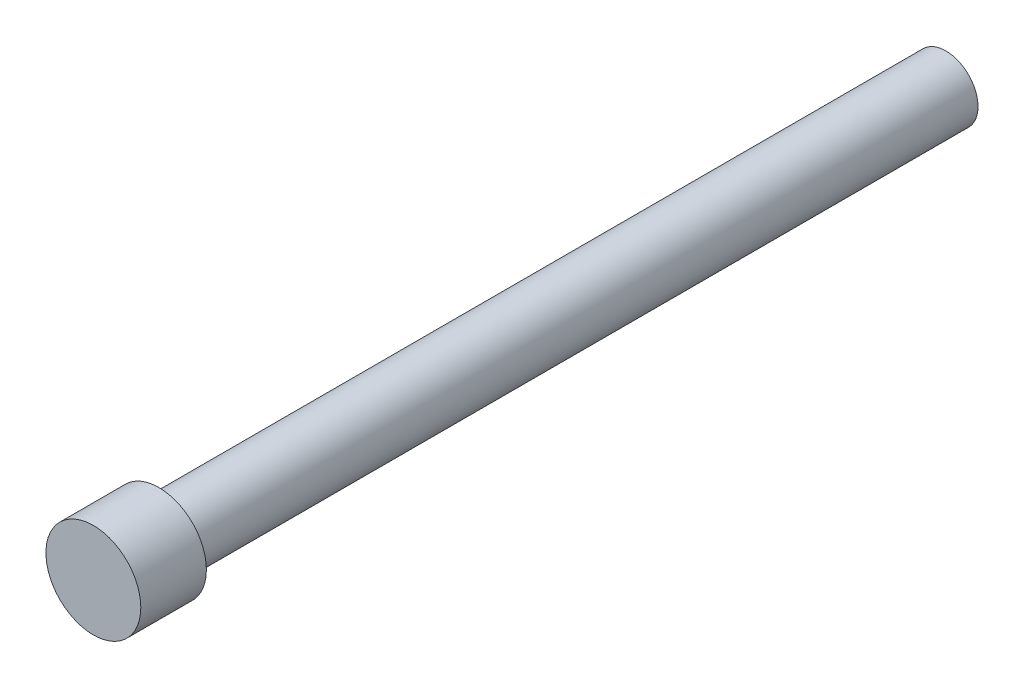
ISO-10303-21;
HEADER;
FILE_DESCRIPTION(('STEP AP214'),'2;1');
FILE_NAME('part.step','',(''),(''),'','','');
FILE_SCHEMA(('AUTOMOTIVE_DESIGN { 1 0 10303 214 1 1 1 1 }'));
ENDSEC;
DATA;
#1=APPLICATION_CONTEXT('core data for automotive mechanical design processes');
#2=APPLICATION_PROTOCOL_DEFINITION('international standard','automotive_design',2000,#1);
#3=PRODUCT_CONTEXT('',#1,'mechanical');
#4=PRODUCT('Part','Part','',(#3));
#5=PRODUCT_RELATED_PRODUCT_CATEGORY('part','',(#4));
#6=PRODUCT_DEFINITION_FORMATION('','',#4);
#7=PRODUCT_DEFINITION_CONTEXT('part definition',#1,'design');
#8=PRODUCT_DEFINITION('design','',#6,#7);
#9=PRODUCT_DEFINITION_SHAPE('','',#8);
#10=(LENGTH_UNIT() NAMED_UNIT(*) SI_UNIT(.MILLI.,.METRE.));
#11=(NAMED_UNIT(*) PLANE_ANGLE_UNIT() SI_UNIT($,.RADIAN.));
#12=(NAMED_UNIT(*) SI_UNIT($,.STERADIAN.) SOLID_ANGLE_UNIT());
#13=UNCERTAINTY_MEASURE_WITH_UNIT(LENGTH_MEASURE(1.E-05),#10,'distance_accuracy_value','');
#14=(GEOMETRIC_REPRESENTATION_CONTEXT(3) GLOBAL_UNCERTAINTY_ASSIGNED_CONTEXT((#13)) GLOBAL_UNIT_ASSIGNED_CONTEXT((#10,
#11,#12)) REPRESENTATION_CONTEXT('',''));
#15=CARTESIAN_POINT('',(0.,0.,0.));
#16=DIRECTION('',(0.,0.,1.));
#17=DIRECTION('',(1.,0.,0.));
#18=AXIS2_PLACEMENT_3D('',#15,#16,#17);
#19=CARTESIAN_POINT('',(-17.2735032288176,7.44180859691808,60.));
#20=DIRECTION('',(0.,0.,-1.));
#21=DIRECTION('',(-1.,0.,0.));
#22=AXIS2_PLACEMENT_3D('',#19,#20,#21);
#23=CYLINDRICAL_SURFACE('',#22,2.45);
#24=CARTESIAN_POINT('',(-17.2735032288176,7.44180859691808,60.));
#25=DIRECTION('',(0.,0.,1.));
#26=DIRECTION('',(1.,0.,0.));
#27=AXIS2_PLACEMENT_3D('',#24,#25,#26);
#28=CIRCLE('',#27,2.45);
#29=CARTESIAN_POINT('',(-14.8235032288176,7.44180859691808,60.));
#30=VERTEX_POINT('',#29);
#31=EDGE_CURVE('E10',#30,#30,#28,.T.);
#32=ORIENTED_EDGE('',*,*,#31,.F.);
#33=EDGE_LOOP('',(#32));
#34=FACE_BOUND('',#33,.T.);
#35=CARTESIAN_POINT('',(-17.2735032288176,7.44180859691808,0.));
#36=DIRECTION('',(0.,0.,1.));
#37=DIRECTION('',(1.,0.,0.));
#38=AXIS2_PLACEMENT_3D('',#35,#36,#37);
#39=CIRCLE('',#38,2.45);
#40=CARTESIAN_POINT('',(-14.8235032288176,7.44180859691808,0.));
#41=VERTEX_POINT('',#40);
#42=EDGE_CURVE('E36',#41,#41,#39,.T.);
#43=ORIENTED_EDGE('',*,*,#42,.T.);
#44=EDGE_LOOP('',(#43));
#45=FACE_BOUND('',#44,.T.);
#46=ADVANCED_FACE('F33',(#34,#45),#23,.T.);
#47=CARTESIAN_POINT('',(-17.2735032288176,7.44180859691808,0.));
#48=DIRECTION('',(0.,0.,1.));
#49=DIRECTION('',(1.,0.,0.));
#50=AXIS2_PLACEMENT_3D('',#47,#48,#49);
#51=PLANE('',#50);
#52=ORIENTED_EDGE('',*,*,#42,.F.);
#53=EDGE_LOOP('',(#52));
#54=FACE_BOUND('',#53,.T.);
#55=ADVANCED_FACE('F61',(#54),#51,.F.);
#56=CARTESIAN_POINT('',(0.,0.,60.));
#57=DIRECTION('',(0.,0.,1.));
#58=DIRECTION('',(1.,0.,0.));
#59=AXIS2_PLACEMENT_3D('',#56,#57,#58);
#60=PLANE('',#59);
#61=CARTESIAN_POINT('',(-17.2735032288176,7.44180859691808,60.));
#62=DIRECTION('',(0.,0.,1.));
#63=DIRECTION('',(1.,0.,0.));
#64=AXIS2_PLACEMENT_3D('',#61,#62,#63);
#65=CIRCLE('',#64,3.61759878289181);
#66=CARTESIAN_POINT('',(-13.6559044459258,7.44180859691808,60.));
#67=VERTEX_POINT('',#66);
#68=EDGE_CURVE('E45',#67,#67,#65,.T.);
#69=ORIENTED_EDGE('',*,*,#68,.F.);
#70=EDGE_LOOP('',(#69));
#71=FACE_BOUND('',#70,.T.);
#72=ORIENTED_EDGE('',*,*,#31,.T.);
#73=EDGE_LOOP('',(#72));
#74=FACE_BOUND('',#73,.T.);
#75=ADVANCED_FACE('F56',(#71,#74),#60,.F.);
#76=CARTESIAN_POINT('',(-17.2735032288176,7.44180859691808,65.));
#77=DIRECTION('',(0.,0.,-1.));
#78=DIRECTION('',(-1.,0.,0.));
#79=AXIS2_PLACEMENT_3D('',#76,#77,#78);
#80=CYLINDRICAL_SURFACE('',#79,3.61759878289181);
#81=CARTESIAN_POINT('',(-17.2735032288176,7.44180859691808,65.));
#82=DIRECTION('',(0.,0.,1.));
#83=DIRECTION('',(1.,0.,0.));
#84=AXIS2_PLACEMENT_3D('',#81,#82,#83);
#85=CIRCLE('',#84,3.61759878289181);
#86=CARTESIAN_POINT('',(-13.6559044459258,7.44180859691808,65.));
#87=VERTEX_POINT('',#86);
#88=EDGE_CURVE('E43',#87,#87,#85,.T.);
#89=ORIENTED_EDGE('',*,*,#88,.F.);
#90=EDGE_LOOP('',(#89));
#91=FACE_BOUND('',#90,.T.);
#92=ORIENTED_EDGE('',*,*,#68,.T.);
#93=EDGE_LOOP('',(#92));
#94=FACE_BOUND('',#93,.T.);
#95=ADVANCED_FACE('F53',(#91,#94),#80,.T.);
#96=CARTESIAN_POINT('',(0.,0.,65.));
#97=DIRECTION('',(0.,0.,1.));
#98=DIRECTION('',(1.,0.,0.));
#99=AXIS2_PLACEMENT_3D('',#96,#97,#98);
#100=PLANE('',#99);
#101=ORIENTED_EDGE('',*,*,#88,.T.);
#102=EDGE_LOOP('',(#101));
#103=FACE_BOUND('',#102,.T.);
#104=ADVANCED_FACE('F51',(#103),#100,.T.);
#105=CLOSED_SHELL('',(#46,#55,#75,#95,#104));
#106=MANIFOLD_SOLID_BREP('B2',#105);
#107=ADVANCED_BREP_SHAPE_REPRESENTATION('',(#18,#106),#14);
#108=SHAPE_DEFINITION_REPRESENTATION(#9,#107);
ENDSEC;
END-ISO-10303-21;
